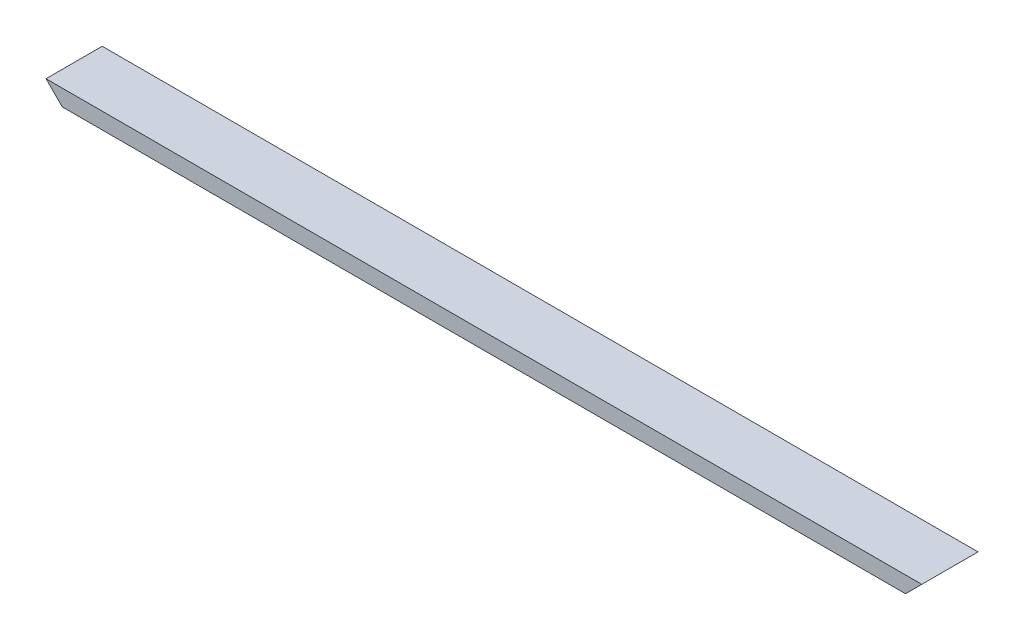
ISO-10303-21;
HEADER;
FILE_DESCRIPTION(('STEP AP214'),'2;1');
FILE_NAME('part.step','',(''),(''),'','','');
FILE_SCHEMA(('AUTOMOTIVE_DESIGN { 1 0 10303 214 1 1 1 1 }'));
ENDSEC;
DATA;
#1=APPLICATION_CONTEXT('core data for automotive mechanical design processes');
#2=APPLICATION_PROTOCOL_DEFINITION('international standard','automotive_design',2000,#1);
#3=PRODUCT_CONTEXT('',#1,'mechanical');
#4=PRODUCT('Part','Part','',(#3));
#5=PRODUCT_RELATED_PRODUCT_CATEGORY('part','',(#4));
#6=PRODUCT_DEFINITION_FORMATION('','',#4);
#7=PRODUCT_DEFINITION_CONTEXT('part definition',#1,'design');
#8=PRODUCT_DEFINITION('design','',#6,#7);
#9=PRODUCT_DEFINITION_SHAPE('','',#8);
#10=(LENGTH_UNIT() NAMED_UNIT(*) SI_UNIT(.MILLI.,.METRE.));
#11=(NAMED_UNIT(*) PLANE_ANGLE_UNIT() SI_UNIT($,.RADIAN.));
#12=(NAMED_UNIT(*) SI_UNIT($,.STERADIAN.) SOLID_ANGLE_UNIT());
#13=UNCERTAINTY_MEASURE_WITH_UNIT(LENGTH_MEASURE(1.E-05),#10,'distance_accuracy_value','');
#14=(GEOMETRIC_REPRESENTATION_CONTEXT(3) GLOBAL_UNCERTAINTY_ASSIGNED_CONTEXT((#13)) GLOBAL_UNIT_ASSIGNED_CONTEXT((#10,
#11,#12)) REPRESENTATION_CONTEXT('',''));
#15=CARTESIAN_POINT('',(0.,0.,0.));
#16=DIRECTION('',(0.,0.,1.));
#17=DIRECTION('',(1.,0.,0.));
#18=AXIS2_PLACEMENT_3D('',#15,#16,#17);
#19=CARTESIAN_POINT('',(592.,-5.5,-19.));
#20=DIRECTION('',(0.,0.,1.));
#21=DIRECTION('',(1.,0.,0.));
#22=AXIS2_PLACEMENT_3D('',#19,#20,#21);
#23=PLANE('',#22);
#24=DIRECTION('',(-1.,0.,0.));
#25=VECTOR('',#24,1.);
#26=CARTESIAN_POINT('',(592.,5.5,-19.));
#27=LINE('',#26,#25);
#28=CARTESIAN_POINT('',(592.,5.5,-19.));
#29=VERTEX_POINT('',#28);
#30=CARTESIAN_POINT('',(0.,5.5,-19.));
#31=VERTEX_POINT('',#30);
#32=EDGE_CURVE('E47',#29,#31,#27,.T.);
#33=ORIENTED_EDGE('',*,*,#32,.F.);
#34=DIRECTION('',(-0.707106781186544,-0.707106781186551,0.));
#35=VECTOR('',#34,1.);
#36=CARTESIAN_POINT('',(586.5,0.,-19.));
#37=LINE('',#36,#35);
#38=CARTESIAN_POINT('',(581.,-5.5,-19.));
#39=VERTEX_POINT('',#38);
#40=EDGE_CURVE('E62',#29,#39,#37,.T.);
#41=ORIENTED_EDGE('',*,*,#40,.T.);
#42=DIRECTION('',(-1.,0.,0.));
#43=VECTOR('',#42,1.);
#44=CARTESIAN_POINT('',(592.,-5.5,-19.));
#45=LINE('',#44,#43);
#46=CARTESIAN_POINT('',(10.9999999999999,-5.5,-19.));
#47=VERTEX_POINT('',#46);
#48=EDGE_CURVE('E127',#39,#47,#45,.T.);
#49=ORIENTED_EDGE('',*,*,#48,.T.);
#50=DIRECTION('',(0.707106781186544,-0.707106781186551,0.));
#51=VECTOR('',#50,1.);
#52=CARTESIAN_POINT('',(301.499999999997,-296.,-19.));
#53=LINE('',#52,#51);
#54=EDGE_CURVE('E143',#31,#47,#53,.T.);
#55=ORIENTED_EDGE('',*,*,#54,.F.);
#56=EDGE_LOOP('',(#33,#41,#49,#55));
#57=FACE_BOUND('',#56,.T.);
#58=ADVANCED_FACE('F39',(#57),#23,.F.);
#59=CARTESIAN_POINT('',(592.,-5.5,19.));
#60=DIRECTION('',(0.,0.,-1.));
#61=DIRECTION('',(-1.,0.,0.));
#62=AXIS2_PLACEMENT_3D('',#59,#60,#61);
#63=PLANE('',#62);
#64=DIRECTION('',(-1.,0.,0.));
#65=VECTOR('',#64,1.);
#66=CARTESIAN_POINT('',(592.,-5.5,19.));
#67=LINE('',#66,#65);
#68=CARTESIAN_POINT('',(581.,-5.5,19.));
#69=VERTEX_POINT('',#68);
#70=CARTESIAN_POINT('',(10.9999999999999,-5.5,19.));
#71=VERTEX_POINT('',#70);
#72=EDGE_CURVE('E116',#69,#71,#67,.T.);
#73=ORIENTED_EDGE('',*,*,#72,.F.);
#74=DIRECTION('',(0.707106781186544,0.707106781186551,0.));
#75=VECTOR('',#74,1.);
#76=CARTESIAN_POINT('',(586.5,0.,19.));
#77=LINE('',#76,#75);
#78=CARTESIAN_POINT('',(592.,5.5,19.));
#79=VERTEX_POINT('',#78);
#80=EDGE_CURVE('E119',#69,#79,#77,.T.);
#81=ORIENTED_EDGE('',*,*,#80,.T.);
#82=DIRECTION('',(-1.,0.,0.));
#83=VECTOR('',#82,1.);
#84=CARTESIAN_POINT('',(592.,5.5,19.));
#85=LINE('',#84,#83);
#86=CARTESIAN_POINT('',(0.,5.5,19.));
#87=VERTEX_POINT('',#86);
#88=EDGE_CURVE('E104',#79,#87,#85,.T.);
#89=ORIENTED_EDGE('',*,*,#88,.T.);
#90=DIRECTION('',(-0.707106781186544,0.707106781186551,0.));
#91=VECTOR('',#90,1.);
#92=CARTESIAN_POINT('',(301.499999999997,-296.,19.));
#93=LINE('',#92,#91);
#94=EDGE_CURVE('E144',#71,#87,#93,.T.);
#95=ORIENTED_EDGE('',*,*,#94,.F.);
#96=EDGE_LOOP('',(#73,#81,#89,#95));
#97=FACE_BOUND('',#96,.T.);
#98=ADVANCED_FACE('F120',(#97),#63,.F.);
#99=CARTESIAN_POINT('',(592.,-5.5,19.));
#100=DIRECTION('',(0.,1.,0.));
#101=DIRECTION('',(0.,0.,1.));
#102=AXIS2_PLACEMENT_3D('',#99,#100,#101);
#103=PLANE('',#102);
#104=ORIENTED_EDGE('',*,*,#48,.F.);
#105=DIRECTION('',(0.,0.,1.));
#106=VECTOR('',#105,1.);
#107=CARTESIAN_POINT('',(581.,-5.5,-760.650397761641));
#108=LINE('',#107,#106);
#109=EDGE_CURVE('E54',#39,#69,#108,.T.);
#110=ORIENTED_EDGE('',*,*,#109,.T.);
#111=ORIENTED_EDGE('',*,*,#72,.T.);
#112=DIRECTION('',(0.,0.,1.));
#113=VECTOR('',#112,1.);
#114=CARTESIAN_POINT('',(10.9999999999999,-5.5,-760.650397761641));
#115=LINE('',#114,#113);
#116=EDGE_CURVE('E146',#47,#71,#115,.T.);
#117=ORIENTED_EDGE('',*,*,#116,.F.);
#118=EDGE_LOOP('',(#104,#110,#111,#117));
#119=FACE_BOUND('',#118,.T.);
#120=ADVANCED_FACE('F223',(#119),#103,.F.);
#121=CARTESIAN_POINT('',(592.,-4.,17.5));
#122=DIRECTION('',(0.,0.,-1.));
#123=DIRECTION('',(-1.,0.,0.));
#124=AXIS2_PLACEMENT_3D('',#121,#122,#123);
#125=PLANE('',#124);
#126=DIRECTION('',(0.707106781186544,0.707106781186551,0.));
#127=VECTOR('',#126,1.);
#128=CARTESIAN_POINT('',(587.25,0.749999999999956,17.5));
#129=LINE('',#128,#127);
#130=CARTESIAN_POINT('',(582.5,-4.,17.5));
#131=VERTEX_POINT('',#130);
#132=CARTESIAN_POINT('',(590.5,4.,17.5));
#133=VERTEX_POINT('',#132);
#134=EDGE_CURVE('E123',#131,#133,#129,.T.);
#135=ORIENTED_EDGE('',*,*,#134,.F.);
#136=DIRECTION('',(-1.,0.,0.));
#137=VECTOR('',#136,1.);
#138=CARTESIAN_POINT('',(592.,-4.,17.5));
#139=LINE('',#138,#137);
#140=CARTESIAN_POINT('',(9.49999999999995,-4.,17.5));
#141=VERTEX_POINT('',#140);
#142=EDGE_CURVE('E132',#131,#141,#139,.T.);
#143=ORIENTED_EDGE('',*,*,#142,.T.);
#144=DIRECTION('',(-0.707106781186544,0.707106781186551,0.));
#145=VECTOR('',#144,1.);
#146=CARTESIAN_POINT('',(300.749999999997,-295.25,17.5));
#147=LINE('',#146,#145);
#148=CARTESIAN_POINT('',(1.49999999999995,4.,17.5));
#149=VERTEX_POINT('',#148);
#150=EDGE_CURVE('E148',#141,#149,#147,.T.);
#151=ORIENTED_EDGE('',*,*,#150,.T.);
#152=DIRECTION('',(-1.,0.,0.));
#153=VECTOR('',#152,1.);
#154=CARTESIAN_POINT('',(592.,4.,17.5));
#155=LINE('',#154,#153);
#156=EDGE_CURVE('E152',#133,#149,#155,.T.);
#157=ORIENTED_EDGE('',*,*,#156,.F.);
#158=EDGE_LOOP('',(#135,#143,#151,#157));
#159=FACE_BOUND('',#158,.T.);
#160=ADVANCED_FACE('F173',(#159),#125,.T.);
#161=CARTESIAN_POINT('',(592.,-4.,17.5));
#162=DIRECTION('',(0.,1.,0.));
#163=DIRECTION('',(0.,0.,1.));
#164=AXIS2_PLACEMENT_3D('',#161,#162,#163);
#165=PLANE('',#164);
#166=DIRECTION('',(0.,0.,1.));
#167=VECTOR('',#166,1.);
#168=CARTESIAN_POINT('',(582.5,-4.,17.5));
#169=LINE('',#168,#167);
#170=CARTESIAN_POINT('',(582.5,-4.,-17.5));
#171=VERTEX_POINT('',#170);
#172=EDGE_CURVE('E193',#171,#131,#169,.T.);
#173=ORIENTED_EDGE('',*,*,#172,.F.);
#174=DIRECTION('',(-1.,0.,0.));
#175=VECTOR('',#174,1.);
#176=CARTESIAN_POINT('',(592.,-4.,-17.5));
#177=LINE('',#176,#175);
#178=CARTESIAN_POINT('',(9.49999999999995,-3.99999999999995,-17.5));
#179=VERTEX_POINT('',#178);
#180=EDGE_CURVE('E163',#171,#179,#177,.T.);
#181=ORIENTED_EDGE('',*,*,#180,.T.);
#182=DIRECTION('',(0.,0.,1.));
#183=VECTOR('',#182,1.);
#184=CARTESIAN_POINT('',(9.49999999999995,-4.,17.5));
#185=LINE('',#184,#183);
#186=EDGE_CURVE('E155',#179,#141,#185,.T.);
#187=ORIENTED_EDGE('',*,*,#186,.T.);
#188=ORIENTED_EDGE('',*,*,#142,.F.);
#189=EDGE_LOOP('',(#173,#181,#187,#188));
#190=FACE_BOUND('',#189,.T.);
#191=ADVANCED_FACE('F181',(#190),#165,.T.);
#192=CARTESIAN_POINT('',(592.,-4.,-17.5));
#193=DIRECTION('',(0.,0.,1.));
#194=DIRECTION('',(0.,-1.,0.));
#195=AXIS2_PLACEMENT_3D('',#192,#193,#194);
#196=PLANE('',#195);
#197=DIRECTION('',(-0.707106781186544,-0.707106781186551,0.));
#198=VECTOR('',#197,1.);
#199=CARTESIAN_POINT('',(587.25,0.749999999999956,-17.5));
#200=LINE('',#199,#198);
#201=CARTESIAN_POINT('',(590.5,4.,-17.5));
#202=VERTEX_POINT('',#201);
#203=EDGE_CURVE('E196',#202,#171,#200,.T.);
#204=ORIENTED_EDGE('',*,*,#203,.F.);
#205=DIRECTION('',(-1.,0.,0.));
#206=VECTOR('',#205,1.);
#207=CARTESIAN_POINT('',(592.,4.,-17.5));
#208=LINE('',#207,#206);
#209=CARTESIAN_POINT('',(1.49999999999995,4.,-17.5));
#210=VERTEX_POINT('',#209);
#211=EDGE_CURVE('E161',#202,#210,#208,.T.);
#212=ORIENTED_EDGE('',*,*,#211,.T.);
#213=DIRECTION('',(0.707106781186544,-0.707106781186551,0.));
#214=VECTOR('',#213,1.);
#215=CARTESIAN_POINT('',(300.749999999997,-295.25,-17.4999999999999));
#216=LINE('',#215,#214);
#217=EDGE_CURVE('E183',#210,#179,#216,.T.);
#218=ORIENTED_EDGE('',*,*,#217,.T.);
#219=ORIENTED_EDGE('',*,*,#180,.F.);
#220=EDGE_LOOP('',(#204,#212,#218,#219));
#221=FACE_BOUND('',#220,.T.);
#222=ADVANCED_FACE('F210',(#221),#196,.T.);
#223=CARTESIAN_POINT('',(592.,4.,17.5));
#224=DIRECTION('',(0.,-1.,0.));
#225=DIRECTION('',(0.,0.,-1.));
#226=AXIS2_PLACEMENT_3D('',#223,#224,#225);
#227=PLANE('',#226);
#228=DIRECTION('',(0.,0.,-1.));
#229=VECTOR('',#228,1.);
#230=CARTESIAN_POINT('',(590.5,4.,17.5));
#231=LINE('',#230,#229);
#232=EDGE_CURVE('E200',#133,#202,#231,.T.);
#233=ORIENTED_EDGE('',*,*,#232,.F.);
#234=ORIENTED_EDGE('',*,*,#156,.T.);
#235=DIRECTION('',(0.,0.,-1.));
#236=VECTOR('',#235,1.);
#237=CARTESIAN_POINT('',(1.49999999999995,4.,17.5));
#238=LINE('',#237,#236);
#239=EDGE_CURVE('E11',#149,#210,#238,.T.);
#240=ORIENTED_EDGE('',*,*,#239,.T.);
#241=ORIENTED_EDGE('',*,*,#211,.F.);
#242=EDGE_LOOP('',(#233,#234,#240,#241));
#243=FACE_BOUND('',#242,.T.);
#244=ADVANCED_FACE('F208',(#243),#227,.T.);
#245=CARTESIAN_POINT('',(592.,5.5,19.));
#246=DIRECTION('',(0.,-1.,0.));
#247=DIRECTION('',(0.,0.,-1.));
#248=AXIS2_PLACEMENT_3D('',#245,#246,#247);
#249=PLANE('',#248);
#250=DIRECTION('',(0.,0.,1.));
#251=VECTOR('',#250,1.);
#252=CARTESIAN_POINT('',(0.,5.5,19.));
#253=LINE('',#252,#251);
#254=EDGE_CURVE('E111',#31,#87,#253,.T.);
#255=ORIENTED_EDGE('',*,*,#254,.T.);
#256=ORIENTED_EDGE('',*,*,#88,.F.);
#257=DIRECTION('',(0.,0.,1.));
#258=VECTOR('',#257,1.);
#259=CARTESIAN_POINT('',(592.,5.5,19.));
#260=LINE('',#259,#258);
#261=EDGE_CURVE('E109',#29,#79,#260,.T.);
#262=ORIENTED_EDGE('',*,*,#261,.F.);
#263=ORIENTED_EDGE('',*,*,#32,.T.);
#264=EDGE_LOOP('',(#255,#256,#262,#263));
#265=FACE_BOUND('',#264,.T.);
#266=ADVANCED_FACE('F106',(#265),#249,.F.);
#267=CARTESIAN_POINT('',(0.,5.5,-760.650397761641));
#268=DIRECTION('',(-0.707106781186551,-0.707106781186544,0.));
#269=DIRECTION('',(0.707106781186544,-0.707106781186551,0.));
#270=AXIS2_PLACEMENT_3D('',#267,#268,#269);
#271=PLANE('',#270);
#272=ORIENTED_EDGE('',*,*,#150,.F.);
#273=ORIENTED_EDGE('',*,*,#186,.F.);
#274=ORIENTED_EDGE('',*,*,#217,.F.);
#275=ORIENTED_EDGE('',*,*,#239,.F.);
#276=EDGE_LOOP('',(#272,#273,#274,#275));
#277=FACE_BOUND('',#276,.T.);
#278=ORIENTED_EDGE('',*,*,#254,.F.);
#279=ORIENTED_EDGE('',*,*,#54,.T.);
#280=ORIENTED_EDGE('',*,*,#116,.T.);
#281=ORIENTED_EDGE('',*,*,#94,.T.);
#282=EDGE_LOOP('',(#278,#279,#280,#281));
#283=FACE_BOUND('',#282,.T.);
#284=ADVANCED_FACE('F141',(#277,#283),#271,.T.);
#285=CARTESIAN_POINT('',(592.,5.5,-760.650397761641));
#286=DIRECTION('',(-0.707106781186551,0.707106781186544,0.));
#287=DIRECTION('',(-0.707106781186544,-0.707106781186551,0.));
#288=AXIS2_PLACEMENT_3D('',#285,#286,#287);
#289=PLANE('',#288);
#290=ORIENTED_EDGE('',*,*,#172,.T.);
#291=ORIENTED_EDGE('',*,*,#134,.T.);
#292=ORIENTED_EDGE('',*,*,#232,.T.);
#293=ORIENTED_EDGE('',*,*,#203,.T.);
#294=EDGE_LOOP('',(#290,#291,#292,#293));
#295=FACE_BOUND('',#294,.T.);
#296=ORIENTED_EDGE('',*,*,#40,.F.);
#297=ORIENTED_EDGE('',*,*,#261,.T.);
#298=ORIENTED_EDGE('',*,*,#80,.F.);
#299=ORIENTED_EDGE('',*,*,#109,.F.);
#300=EDGE_LOOP('',(#296,#297,#298,#299));
#301=FACE_BOUND('',#300,.T.);
#302=ADVANCED_FACE('F125',(#295,#301),#289,.F.);
#303=CLOSED_SHELL('',(#58,#98,#120,#160,#191,#222,#244,#266,#284,#302));
#304=MANIFOLD_SOLID_BREP('B2',#303);
#305=ADVANCED_BREP_SHAPE_REPRESENTATION('',(#18,#304),#14);
#306=SHAPE_DEFINITION_REPRESENTATION(#9,#305);
ENDSEC;
END-ISO-10303-21;
